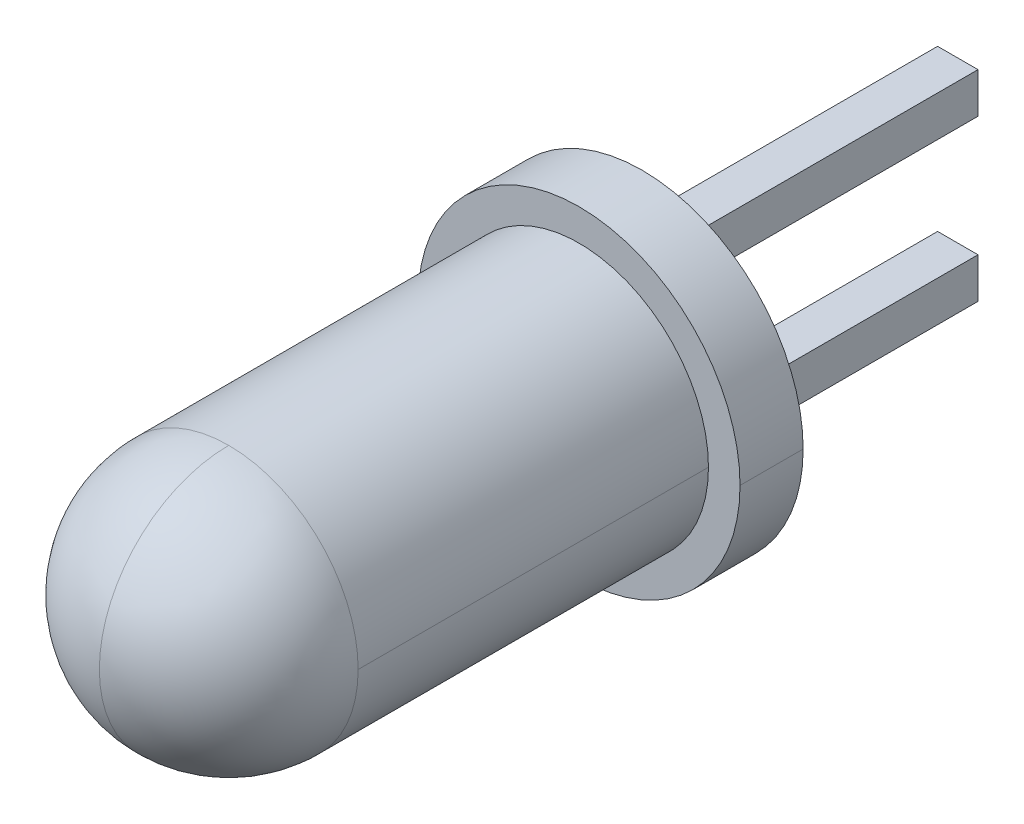
ISO-10303-21;
HEADER;
FILE_DESCRIPTION(('STEP AP214'),'2;1');
FILE_NAME('part.step','',(''),(''),'','','');
FILE_SCHEMA(('AUTOMOTIVE_DESIGN { 1 0 10303 214 1 1 1 1 }'));
ENDSEC;
DATA;
#1=APPLICATION_CONTEXT('core data for automotive mechanical design processes');
#2=APPLICATION_PROTOCOL_DEFINITION('international standard','automotive_design',2000,#1);
#3=PRODUCT_CONTEXT('',#1,'mechanical');
#4=PRODUCT('Part','Part','',(#3));
#5=PRODUCT_RELATED_PRODUCT_CATEGORY('part','',(#4));
#6=PRODUCT_DEFINITION_FORMATION('','',#4);
#7=PRODUCT_DEFINITION_CONTEXT('part definition',#1,'design');
#8=PRODUCT_DEFINITION('design','',#6,#7);
#9=PRODUCT_DEFINITION_SHAPE('','',#8);
#10=(LENGTH_UNIT() NAMED_UNIT(*) SI_UNIT(.MILLI.,.METRE.));
#11=(NAMED_UNIT(*) PLANE_ANGLE_UNIT() SI_UNIT($,.RADIAN.));
#12=(NAMED_UNIT(*) SI_UNIT($,.STERADIAN.) SOLID_ANGLE_UNIT());
#13=UNCERTAINTY_MEASURE_WITH_UNIT(LENGTH_MEASURE(1.E-05),#10,'distance_accuracy_value','');
#14=(GEOMETRIC_REPRESENTATION_CONTEXT(3) GLOBAL_UNCERTAINTY_ASSIGNED_CONTEXT((#13)) GLOBAL_UNIT_ASSIGNED_CONTEXT((#10,
#11,#12)) REPRESENTATION_CONTEXT('',''));
#15=CARTESIAN_POINT('',(0.,0.,0.));
#16=DIRECTION('',(0.,0.,1.));
#17=DIRECTION('',(1.,0.,0.));
#18=AXIS2_PLACEMENT_3D('',#15,#16,#17);
#19=CARTESIAN_POINT('',(0.,0.,6.55));
#20=DIRECTION('',(1.,0.,0.));
#21=DIRECTION('',(0.,1.,0.));
#22=AXIS2_PLACEMENT_3D('',#19,#20,#21);
#23=SPHERICAL_SURFACE('',#22,2.05);
#24=CARTESIAN_POINT('',(0.,0.,6.55));
#25=DIRECTION('',(-1.,0.,0.));
#26=DIRECTION('',(0.,0.,1.));
#27=AXIS2_PLACEMENT_3D('',#24,#25,#26);
#28=CIRCLE('',#27,2.05);
#29=CARTESIAN_POINT('',(0.,0.,8.6));
#30=VERTEX_POINT('',#29);
#31=CARTESIAN_POINT('',(0.,2.05,6.55));
#32=VERTEX_POINT('',#31);
#33=EDGE_CURVE('E41',#30,#32,#28,.T.);
#34=ORIENTED_EDGE('',*,*,#33,.F.);
#35=CARTESIAN_POINT('',(0.,0.,6.55));
#36=DIRECTION('',(1.,0.,0.));
#37=DIRECTION('',(0.,1.,0.));
#38=AXIS2_PLACEMENT_3D('',#35,#36,#37);
#39=CIRCLE('',#38,2.05);
#40=CARTESIAN_POINT('',(0.,-2.05,6.55));
#41=VERTEX_POINT('',#40);
#42=EDGE_CURVE('E11',#30,#41,#39,.T.);
#43=ORIENTED_EDGE('',*,*,#42,.T.);
#44=CARTESIAN_POINT('',(0.,0.,6.55));
#45=DIRECTION('',(0.,0.,-1.));
#46=DIRECTION('',(-1.,0.,0.));
#47=AXIS2_PLACEMENT_3D('',#44,#45,#46);
#48=CIRCLE('',#47,2.05);
#49=CARTESIAN_POINT('',(2.05,0.,6.55));
#50=VERTEX_POINT('',#49);
#51=EDGE_CURVE('E256',#50,#41,#48,.T.);
#52=ORIENTED_EDGE('',*,*,#51,.F.);
#53=CARTESIAN_POINT('',(0.,0.,6.55));
#54=DIRECTION('',(0.,0.,-1.));
#55=DIRECTION('',(-1.,0.,0.));
#56=AXIS2_PLACEMENT_3D('',#53,#54,#55);
#57=CIRCLE('',#56,2.05);
#58=EDGE_CURVE('E205',#32,#50,#57,.T.);
#59=ORIENTED_EDGE('',*,*,#58,.F.);
#60=EDGE_LOOP('',(#34,#43,#52,#59));
#61=FACE_BOUND('',#60,.T.);
#62=ADVANCED_FACE('F16',(#61),#23,.T.);
#63=CARTESIAN_POINT('',(0.,0.,0.));
#64=DIRECTION('',(0.,0.,-1.));
#65=DIRECTION('',(-1.,0.,0.));
#66=AXIS2_PLACEMENT_3D('',#63,#64,#65);
#67=CYLINDRICAL_SURFACE('',#66,2.05);
#68=CARTESIAN_POINT('',(0.,0.,6.55));
#69=DIRECTION('',(0.,0.,-1.));
#70=DIRECTION('',(-1.,0.,0.));
#71=AXIS2_PLACEMENT_3D('',#68,#69,#70);
#72=CIRCLE('',#71,2.05);
#73=CARTESIAN_POINT('',(-2.05,0.,6.55));
#74=VERTEX_POINT('',#73);
#75=EDGE_CURVE('E27',#74,#32,#72,.T.);
#76=ORIENTED_EDGE('',*,*,#75,.T.);
#77=ORIENTED_EDGE('',*,*,#58,.T.);
#78=DIRECTION('',(0.,0.,-1.));
#79=VECTOR('',#78,1.);
#80=CARTESIAN_POINT('',(2.05,0.,0.));
#81=LINE('',#80,#79);
#82=CARTESIAN_POINT('',(2.05,0.,1.));
#83=VERTEX_POINT('',#82);
#84=EDGE_CURVE('E209',#50,#83,#81,.T.);
#85=ORIENTED_EDGE('',*,*,#84,.T.);
#86=CARTESIAN_POINT('',(0.,0.,1.));
#87=DIRECTION('',(0.,0.,-1.));
#88=DIRECTION('',(-1.,0.,0.));
#89=AXIS2_PLACEMENT_3D('',#86,#87,#88);
#90=CIRCLE('',#89,2.05);
#91=CARTESIAN_POINT('',(-2.05,0.,1.));
#92=VERTEX_POINT('',#91);
#93=EDGE_CURVE('E184',#92,#83,#90,.T.);
#94=ORIENTED_EDGE('',*,*,#93,.F.);
#95=DIRECTION('',(0.,0.,-1.));
#96=VECTOR('',#95,1.);
#97=CARTESIAN_POINT('',(-2.05,0.,0.));
#98=LINE('',#97,#96);
#99=EDGE_CURVE('E176',#74,#92,#98,.T.);
#100=ORIENTED_EDGE('',*,*,#99,.F.);
#101=EDGE_LOOP('',(#76,#77,#85,#94,#100));
#102=FACE_BOUND('',#101,.T.);
#103=ADVANCED_FACE('F337',(#102),#67,.T.);
#104=CARTESIAN_POINT('',(0.,0.,0.));
#105=DIRECTION('',(0.,0.,-1.));
#106=DIRECTION('',(-1.,0.,0.));
#107=AXIS2_PLACEMENT_3D('',#104,#105,#106);
#108=CYLINDRICAL_SURFACE('',#107,2.55);
#109=CARTESIAN_POINT('',(0.,0.,1.));
#110=DIRECTION('',(0.,0.,-1.));
#111=DIRECTION('',(-1.,0.,0.));
#112=AXIS2_PLACEMENT_3D('',#109,#110,#111);
#113=CIRCLE('',#112,2.55);
#114=CARTESIAN_POINT('',(-2.55,0.,1.));
#115=VERTEX_POINT('',#114);
#116=CARTESIAN_POINT('',(2.55,0.,1.));
#117=VERTEX_POINT('',#116);
#118=EDGE_CURVE('E232',#115,#117,#113,.T.);
#119=ORIENTED_EDGE('',*,*,#118,.T.);
#120=DIRECTION('',(0.,0.,-1.));
#121=VECTOR('',#120,1.);
#122=CARTESIAN_POINT('',(2.55,0.,0.));
#123=LINE('',#122,#121);
#124=CARTESIAN_POINT('',(2.55,0.,0.));
#125=VERTEX_POINT('',#124);
#126=EDGE_CURVE('E244',#117,#125,#123,.T.);
#127=ORIENTED_EDGE('',*,*,#126,.T.);
#128=CARTESIAN_POINT('',(0.,0.,0.));
#129=DIRECTION('',(0.,0.,-1.));
#130=DIRECTION('',(-1.,0.,0.));
#131=AXIS2_PLACEMENT_3D('',#128,#129,#130);
#132=CIRCLE('',#131,2.55);
#133=CARTESIAN_POINT('',(-2.55,0.,0.));
#134=VERTEX_POINT('',#133);
#135=EDGE_CURVE('E248',#134,#125,#132,.T.);
#136=ORIENTED_EDGE('',*,*,#135,.F.);
#137=DIRECTION('',(0.,0.,-1.));
#138=VECTOR('',#137,1.);
#139=CARTESIAN_POINT('',(-2.55,0.,0.));
#140=LINE('',#139,#138);
#141=EDGE_CURVE('E181',#115,#134,#140,.T.);
#142=ORIENTED_EDGE('',*,*,#141,.F.);
#143=EDGE_LOOP('',(#119,#127,#136,#142));
#144=FACE_BOUND('',#143,.T.);
#145=ADVANCED_FACE('F18',(#144),#108,.T.);
#146=CARTESIAN_POINT('',(0.,0.,0.));
#147=DIRECTION('',(0.,0.,-1.));
#148=DIRECTION('',(0.,-1.,0.));
#149=AXIS2_PLACEMENT_3D('',#146,#147,#148);
#150=PLANE('',#149);
#151=ORIENTED_EDGE('',*,*,#135,.T.);
#152=CARTESIAN_POINT('',(0.,0.,0.));
#153=DIRECTION('',(0.,0.,-1.));
#154=DIRECTION('',(-1.,0.,0.));
#155=AXIS2_PLACEMENT_3D('',#152,#153,#154);
#156=CIRCLE('',#155,2.55);
#157=EDGE_CURVE('E195',#125,#134,#156,.T.);
#158=ORIENTED_EDGE('',*,*,#157,.T.);
#159=EDGE_LOOP('',(#151,#158));
#160=FACE_BOUND('',#159,.T.);
#161=DIRECTION('',(1.,0.,0.));
#162=VECTOR('',#161,1.);
#163=CARTESIAN_POINT('',(-0.32,0.95,0.));
#164=LINE('',#163,#162);
#165=CARTESIAN_POINT('',(-0.32,0.95,0.));
#166=VERTEX_POINT('',#165);
#167=CARTESIAN_POINT('',(0.32,0.95,0.));
#168=VERTEX_POINT('',#167);
#169=EDGE_CURVE('E191',#166,#168,#164,.T.);
#170=ORIENTED_EDGE('',*,*,#169,.T.);
#171=DIRECTION('',(0.,-1.,0.));
#172=VECTOR('',#171,1.);
#173=CARTESIAN_POINT('',(0.32,1.59,0.));
#174=LINE('',#173,#172);
#175=CARTESIAN_POINT('',(0.32,1.59,0.));
#176=VERTEX_POINT('',#175);
#177=EDGE_CURVE('E201',#176,#168,#174,.T.);
#178=ORIENTED_EDGE('',*,*,#177,.F.);
#179=DIRECTION('',(-1.,0.,0.));
#180=VECTOR('',#179,1.);
#181=CARTESIAN_POINT('',(0.32,1.59,0.));
#182=LINE('',#181,#180);
#183=CARTESIAN_POINT('',(-0.32,1.59,0.));
#184=VERTEX_POINT('',#183);
#185=EDGE_CURVE('E174',#176,#184,#182,.T.);
#186=ORIENTED_EDGE('',*,*,#185,.T.);
#187=DIRECTION('',(0.,1.,0.));
#188=VECTOR('',#187,1.);
#189=CARTESIAN_POINT('',(-0.32,0.95,0.));
#190=LINE('',#189,#188);
#191=EDGE_CURVE('E20',#166,#184,#190,.T.);
#192=ORIENTED_EDGE('',*,*,#191,.F.);
#193=EDGE_LOOP('',(#170,#178,#186,#192));
#194=FACE_BOUND('',#193,.T.);
#195=DIRECTION('',(1.,0.,0.));
#196=VECTOR('',#195,1.);
#197=CARTESIAN_POINT('',(-0.32,-1.59,0.));
#198=LINE('',#197,#196);
#199=CARTESIAN_POINT('',(-0.32,-1.59,0.));
#200=VERTEX_POINT('',#199);
#201=CARTESIAN_POINT('',(0.32,-1.59,0.));
#202=VERTEX_POINT('',#201);
#203=EDGE_CURVE('E145',#200,#202,#198,.T.);
#204=ORIENTED_EDGE('',*,*,#203,.T.);
#205=DIRECTION('',(0.,-1.,0.));
#206=VECTOR('',#205,1.);
#207=CARTESIAN_POINT('',(0.32,-0.95,0.));
#208=LINE('',#207,#206);
#209=CARTESIAN_POINT('',(0.32,-0.95,0.));
#210=VERTEX_POINT('',#209);
#211=EDGE_CURVE('E133',#210,#202,#208,.T.);
#212=ORIENTED_EDGE('',*,*,#211,.F.);
#213=DIRECTION('',(-1.,0.,0.));
#214=VECTOR('',#213,1.);
#215=CARTESIAN_POINT('',(0.32,-0.95,0.));
#216=LINE('',#215,#214);
#217=CARTESIAN_POINT('',(-0.32,-0.95,0.));
#218=VERTEX_POINT('',#217);
#219=EDGE_CURVE('E142',#210,#218,#216,.T.);
#220=ORIENTED_EDGE('',*,*,#219,.T.);
#221=DIRECTION('',(0.,1.,0.));
#222=VECTOR('',#221,1.);
#223=CARTESIAN_POINT('',(-0.32,-1.59,0.));
#224=LINE('',#223,#222);
#225=EDGE_CURVE('E210',#200,#218,#224,.T.);
#226=ORIENTED_EDGE('',*,*,#225,.F.);
#227=EDGE_LOOP('',(#204,#212,#220,#226));
#228=FACE_BOUND('',#227,.T.);
#229=ADVANCED_FACE('F141',(#160,#194,#228),#150,.T.);
#230=CARTESIAN_POINT('',(0.,0.,0.));
#231=DIRECTION('',(0.,0.,-1.));
#232=DIRECTION('',(-1.,0.,0.));
#233=AXIS2_PLACEMENT_3D('',#230,#231,#232);
#234=CYLINDRICAL_SURFACE('',#233,2.55);
#235=ORIENTED_EDGE('',*,*,#126,.F.);
#236=CARTESIAN_POINT('',(0.,0.,1.));
#237=DIRECTION('',(0.,0.,-1.));
#238=DIRECTION('',(-1.,0.,0.));
#239=AXIS2_PLACEMENT_3D('',#236,#237,#238);
#240=CIRCLE('',#239,2.55);
#241=EDGE_CURVE('E159',#117,#115,#240,.T.);
#242=ORIENTED_EDGE('',*,*,#241,.T.);
#243=ORIENTED_EDGE('',*,*,#141,.T.);
#244=ORIENTED_EDGE('',*,*,#157,.F.);
#245=EDGE_LOOP('',(#235,#242,#243,#244));
#246=FACE_BOUND('',#245,.T.);
#247=ADVANCED_FACE('F286',(#246),#234,.T.);
#248=CARTESIAN_POINT('',(0.,2.55,1.));
#249=DIRECTION('',(0.,0.,1.));
#250=DIRECTION('',(1.,0.,0.));
#251=AXIS2_PLACEMENT_3D('',#248,#249,#250);
#252=PLANE('',#251);
#253=ORIENTED_EDGE('',*,*,#118,.F.);
#254=ORIENTED_EDGE('',*,*,#241,.F.);
#255=EDGE_LOOP('',(#253,#254));
#256=FACE_BOUND('',#255,.T.);
#257=ORIENTED_EDGE('',*,*,#93,.T.);
#258=CARTESIAN_POINT('',(0.,0.,1.));
#259=DIRECTION('',(0.,0.,-1.));
#260=DIRECTION('',(-1.,0.,0.));
#261=AXIS2_PLACEMENT_3D('',#258,#259,#260);
#262=CIRCLE('',#261,2.05);
#263=EDGE_CURVE('E240',#83,#92,#262,.T.);
#264=ORIENTED_EDGE('',*,*,#263,.T.);
#265=EDGE_LOOP('',(#257,#264));
#266=FACE_BOUND('',#265,.T.);
#267=ADVANCED_FACE('F291',(#256,#266),#252,.T.);
#268=CARTESIAN_POINT('',(0.,0.,0.));
#269=DIRECTION('',(0.,0.,-1.));
#270=DIRECTION('',(-1.,0.,0.));
#271=AXIS2_PLACEMENT_3D('',#268,#269,#270);
#272=CYLINDRICAL_SURFACE('',#271,2.05);
#273=ORIENTED_EDGE('',*,*,#84,.F.);
#274=ORIENTED_EDGE('',*,*,#51,.T.);
#275=CARTESIAN_POINT('',(0.,0.,6.55));
#276=DIRECTION('',(0.,0.,-1.));
#277=DIRECTION('',(-1.,0.,0.));
#278=AXIS2_PLACEMENT_3D('',#275,#276,#277);
#279=CIRCLE('',#278,2.05);
#280=EDGE_CURVE('E180',#41,#74,#279,.T.);
#281=ORIENTED_EDGE('',*,*,#280,.T.);
#282=ORIENTED_EDGE('',*,*,#99,.T.);
#283=ORIENTED_EDGE('',*,*,#263,.F.);
#284=EDGE_LOOP('',(#273,#274,#281,#282,#283));
#285=FACE_BOUND('',#284,.T.);
#286=ADVANCED_FACE('F341',(#285),#272,.T.);
#287=CARTESIAN_POINT('',(0.,0.,6.55));
#288=DIRECTION('',(1.,0.,0.));
#289=DIRECTION('',(0.,1.,0.));
#290=AXIS2_PLACEMENT_3D('',#287,#288,#289);
#291=SPHERICAL_SURFACE('',#290,2.05);
#292=ORIENTED_EDGE('',*,*,#42,.F.);
#293=ORIENTED_EDGE('',*,*,#33,.T.);
#294=ORIENTED_EDGE('',*,*,#75,.F.);
#295=ORIENTED_EDGE('',*,*,#280,.F.);
#296=EDGE_LOOP('',(#292,#293,#294,#295));
#297=FACE_BOUND('',#296,.T.);
#298=ADVANCED_FACE('F333',(#297),#291,.T.);
#299=CARTESIAN_POINT('',(0.32,1.59,-5.));
#300=DIRECTION('',(-1.,0.,0.));
#301=DIRECTION('',(0.,1.,0.));
#302=AXIS2_PLACEMENT_3D('',#299,#300,#301);
#303=PLANE('',#302);
#304=ORIENTED_EDGE('',*,*,#177,.T.);
#305=DIRECTION('',(0.,0.,1.));
#306=VECTOR('',#305,1.);
#307=CARTESIAN_POINT('',(0.32,0.95,-5.));
#308=LINE('',#307,#306);
#309=CARTESIAN_POINT('',(0.32,0.95,-5.));
#310=VERTEX_POINT('',#309);
#311=EDGE_CURVE('E221',#310,#168,#308,.T.);
#312=ORIENTED_EDGE('',*,*,#311,.F.);
#313=DIRECTION('',(0.,-1.,0.));
#314=VECTOR('',#313,1.);
#315=CARTESIAN_POINT('',(0.32,1.59,-5.));
#316=LINE('',#315,#314);
#317=CARTESIAN_POINT('',(0.32,1.59,-5.));
#318=VERTEX_POINT('',#317);
#319=EDGE_CURVE('E200',#318,#310,#316,.T.);
#320=ORIENTED_EDGE('',*,*,#319,.F.);
#321=DIRECTION('',(0.,0.,1.));
#322=VECTOR('',#321,1.);
#323=CARTESIAN_POINT('',(0.32,1.59,-5.));
#324=LINE('',#323,#322);
#325=EDGE_CURVE('E204',#318,#176,#324,.T.);
#326=ORIENTED_EDGE('',*,*,#325,.T.);
#327=EDGE_LOOP('',(#304,#312,#320,#326));
#328=FACE_BOUND('',#327,.T.);
#329=ADVANCED_FACE('F309',(#328),#303,.F.);
#330=CARTESIAN_POINT('',(-0.32,0.95,-5.));
#331=DIRECTION('',(0.,-1.,0.));
#332=DIRECTION('',(0.,0.,-1.));
#333=AXIS2_PLACEMENT_3D('',#330,#331,#332);
#334=PLANE('',#333);
#335=ORIENTED_EDGE('',*,*,#169,.F.);
#336=DIRECTION('',(0.,0.,1.));
#337=VECTOR('',#336,1.);
#338=CARTESIAN_POINT('',(-0.32,0.95,-5.));
#339=LINE('',#338,#337);
#340=CARTESIAN_POINT('',(-0.32,0.95,-5.));
#341=VERTEX_POINT('',#340);
#342=EDGE_CURVE('E186',#341,#166,#339,.T.);
#343=ORIENTED_EDGE('',*,*,#342,.F.);
#344=DIRECTION('',(1.,0.,0.));
#345=VECTOR('',#344,1.);
#346=CARTESIAN_POINT('',(-0.32,0.95,-5.));
#347=LINE('',#346,#345);
#348=EDGE_CURVE('E217',#341,#310,#347,.T.);
#349=ORIENTED_EDGE('',*,*,#348,.T.);
#350=ORIENTED_EDGE('',*,*,#311,.T.);
#351=EDGE_LOOP('',(#335,#343,#349,#350));
#352=FACE_BOUND('',#351,.T.);
#353=ADVANCED_FACE('F306',(#352),#334,.T.);
#354=CARTESIAN_POINT('',(-0.32,0.95,-5.));
#355=DIRECTION('',(1.,0.,0.));
#356=DIRECTION('',(0.,1.,0.));
#357=AXIS2_PLACEMENT_3D('',#354,#355,#356);
#358=PLANE('',#357);
#359=ORIENTED_EDGE('',*,*,#191,.T.);
#360=DIRECTION('',(0.,0.,1.));
#361=VECTOR('',#360,1.);
#362=CARTESIAN_POINT('',(-0.32,1.59,-5.));
#363=LINE('',#362,#361);
#364=CARTESIAN_POINT('',(-0.32,1.59,-5.));
#365=VERTEX_POINT('',#364);
#366=EDGE_CURVE('E196',#365,#184,#363,.T.);
#367=ORIENTED_EDGE('',*,*,#366,.F.);
#368=DIRECTION('',(0.,1.,0.));
#369=VECTOR('',#368,1.);
#370=CARTESIAN_POINT('',(-0.32,0.95,-5.));
#371=LINE('',#370,#369);
#372=EDGE_CURVE('E148',#341,#365,#371,.T.);
#373=ORIENTED_EDGE('',*,*,#372,.F.);
#374=ORIENTED_EDGE('',*,*,#342,.T.);
#375=EDGE_LOOP('',(#359,#367,#373,#374));
#376=FACE_BOUND('',#375,.T.);
#377=ADVANCED_FACE('F319',(#376),#358,.F.);
#378=CARTESIAN_POINT('',(0.32,1.59,-5.));
#379=DIRECTION('',(0.,1.,0.));
#380=DIRECTION('',(1.,0.,0.));
#381=AXIS2_PLACEMENT_3D('',#378,#379,#380);
#382=PLANE('',#381);
#383=ORIENTED_EDGE('',*,*,#185,.F.);
#384=ORIENTED_EDGE('',*,*,#325,.F.);
#385=DIRECTION('',(-1.,0.,0.));
#386=VECTOR('',#385,1.);
#387=CARTESIAN_POINT('',(0.32,1.59,-5.));
#388=LINE('',#387,#386);
#389=EDGE_CURVE('E189',#318,#365,#388,.T.);
#390=ORIENTED_EDGE('',*,*,#389,.T.);
#391=ORIENTED_EDGE('',*,*,#366,.T.);
#392=EDGE_LOOP('',(#383,#384,#390,#391));
#393=FACE_BOUND('',#392,.T.);
#394=ADVANCED_FACE('F313',(#393),#382,.T.);
#395=CARTESIAN_POINT('',(0.32,0.95,-5.));
#396=DIRECTION('',(0.,0.,1.));
#397=DIRECTION('',(1.,0.,0.));
#398=AXIS2_PLACEMENT_3D('',#395,#396,#397);
#399=PLANE('',#398);
#400=ORIENTED_EDGE('',*,*,#319,.T.);
#401=ORIENTED_EDGE('',*,*,#348,.F.);
#402=ORIENTED_EDGE('',*,*,#372,.T.);
#403=ORIENTED_EDGE('',*,*,#389,.F.);
#404=EDGE_LOOP('',(#400,#401,#402,#403));
#405=FACE_BOUND('',#404,.T.);
#406=ADVANCED_FACE('F315',(#405),#399,.F.);
#407=CARTESIAN_POINT('',(0.32,-0.95,-5.));
#408=DIRECTION('',(-1.,0.,0.));
#409=DIRECTION('',(0.,1.,0.));
#410=AXIS2_PLACEMENT_3D('',#407,#408,#409);
#411=PLANE('',#410);
#412=ORIENTED_EDGE('',*,*,#211,.T.);
#413=DIRECTION('',(0.,0.,1.));
#414=VECTOR('',#413,1.);
#415=CARTESIAN_POINT('',(0.32,-1.59,-5.));
#416=LINE('',#415,#414);
#417=CARTESIAN_POINT('',(0.32,-1.59,-5.));
#418=VERTEX_POINT('',#417);
#419=EDGE_CURVE('E171',#418,#202,#416,.T.);
#420=ORIENTED_EDGE('',*,*,#419,.F.);
#421=DIRECTION('',(0.,-1.,0.));
#422=VECTOR('',#421,1.);
#423=CARTESIAN_POINT('',(0.32,-0.95,-5.));
#424=LINE('',#423,#422);
#425=CARTESIAN_POINT('',(0.32,-0.95,-5.));
#426=VERTEX_POINT('',#425);
#427=EDGE_CURVE('E162',#426,#418,#424,.T.);
#428=ORIENTED_EDGE('',*,*,#427,.F.);
#429=DIRECTION('',(0.,0.,1.));
#430=VECTOR('',#429,1.);
#431=CARTESIAN_POINT('',(0.32,-0.95,-5.));
#432=LINE('',#431,#430);
#433=EDGE_CURVE('E149',#426,#210,#432,.T.);
#434=ORIENTED_EDGE('',*,*,#433,.T.);
#435=EDGE_LOOP('',(#412,#420,#428,#434));
#436=FACE_BOUND('',#435,.T.);
#437=ADVANCED_FACE('F161',(#436),#411,.F.);
#438=CARTESIAN_POINT('',(-0.32,-1.59,-5.));
#439=DIRECTION('',(0.,-1.,0.));
#440=DIRECTION('',(-1.,0.,0.));
#441=AXIS2_PLACEMENT_3D('',#438,#439,#440);
#442=PLANE('',#441);
#443=ORIENTED_EDGE('',*,*,#203,.F.);
#444=DIRECTION('',(0.,0.,1.));
#445=VECTOR('',#444,1.);
#446=CARTESIAN_POINT('',(-0.32,-1.59,-5.));
#447=LINE('',#446,#445);
#448=CARTESIAN_POINT('',(-0.32,-1.59,-5.));
#449=VERTEX_POINT('',#448);
#450=EDGE_CURVE('E213',#449,#200,#447,.T.);
#451=ORIENTED_EDGE('',*,*,#450,.F.);
#452=DIRECTION('',(1.,0.,0.));
#453=VECTOR('',#452,1.);
#454=CARTESIAN_POINT('',(-0.32,-1.59,-5.));
#455=LINE('',#454,#453);
#456=EDGE_CURVE('E164',#449,#418,#455,.T.);
#457=ORIENTED_EDGE('',*,*,#456,.T.);
#458=ORIENTED_EDGE('',*,*,#419,.T.);
#459=EDGE_LOOP('',(#443,#451,#457,#458));
#460=FACE_BOUND('',#459,.T.);
#461=ADVANCED_FACE('F376',(#460),#442,.T.);
#462=CARTESIAN_POINT('',(-0.32,-1.59,-5.));
#463=DIRECTION('',(1.,0.,0.));
#464=DIRECTION('',(0.,1.,0.));
#465=AXIS2_PLACEMENT_3D('',#462,#463,#464);
#466=PLANE('',#465);
#467=ORIENTED_EDGE('',*,*,#225,.T.);
#468=DIRECTION('',(0.,0.,1.));
#469=VECTOR('',#468,1.);
#470=CARTESIAN_POINT('',(-0.32,-0.95,-5.));
#471=LINE('',#470,#469);
#472=CARTESIAN_POINT('',(-0.32,-0.95,-5.));
#473=VERTEX_POINT('',#472);
#474=EDGE_CURVE('E157',#473,#218,#471,.T.);
#475=ORIENTED_EDGE('',*,*,#474,.F.);
#476=DIRECTION('',(0.,1.,0.));
#477=VECTOR('',#476,1.);
#478=CARTESIAN_POINT('',(-0.32,-1.59,-5.));
#479=LINE('',#478,#477);
#480=EDGE_CURVE('E224',#449,#473,#479,.T.);
#481=ORIENTED_EDGE('',*,*,#480,.F.);
#482=ORIENTED_EDGE('',*,*,#450,.T.);
#483=EDGE_LOOP('',(#467,#475,#481,#482));
#484=FACE_BOUND('',#483,.T.);
#485=ADVANCED_FACE('F371',(#484),#466,.F.);
#486=CARTESIAN_POINT('',(0.32,-0.95,-5.));
#487=DIRECTION('',(0.,1.,0.));
#488=DIRECTION('',(1.,0.,0.));
#489=AXIS2_PLACEMENT_3D('',#486,#487,#488);
#490=PLANE('',#489);
#491=ORIENTED_EDGE('',*,*,#219,.F.);
#492=ORIENTED_EDGE('',*,*,#433,.F.);
#493=DIRECTION('',(-1.,0.,0.));
#494=VECTOR('',#493,1.);
#495=CARTESIAN_POINT('',(0.32,-0.95,-5.));
#496=LINE('',#495,#494);
#497=EDGE_CURVE('E255',#426,#473,#496,.T.);
#498=ORIENTED_EDGE('',*,*,#497,.T.);
#499=ORIENTED_EDGE('',*,*,#474,.T.);
#500=EDGE_LOOP('',(#491,#492,#498,#499));
#501=FACE_BOUND('',#500,.T.);
#502=ADVANCED_FACE('F153',(#501),#490,.T.);
#503=CARTESIAN_POINT('',(0.32,-0.95,-5.));
#504=DIRECTION('',(0.,0.,-1.));
#505=DIRECTION('',(0.,-1.,0.));
#506=AXIS2_PLACEMENT_3D('',#503,#504,#505);
#507=PLANE('',#506);
#508=ORIENTED_EDGE('',*,*,#427,.T.);
#509=ORIENTED_EDGE('',*,*,#456,.F.);
#510=ORIENTED_EDGE('',*,*,#480,.T.);
#511=ORIENTED_EDGE('',*,*,#497,.F.);
#512=EDGE_LOOP('',(#508,#509,#510,#511));
#513=FACE_BOUND('',#512,.T.);
#514=ADVANCED_FACE('F370',(#513),#507,.T.);
#515=CLOSED_SHELL('',(#62,#103,#145,#229,#247,#267,#286,#298,#329,#353,#377,#394,#406,#437,#461,
#485,#502,#514));
#516=MANIFOLD_SOLID_BREP('B1',#515);
#517=ADVANCED_BREP_SHAPE_REPRESENTATION('',(#18,#516),#14);
#518=SHAPE_DEFINITION_REPRESENTATION(#9,#517);
ENDSEC;
END-ISO-10303-21;
